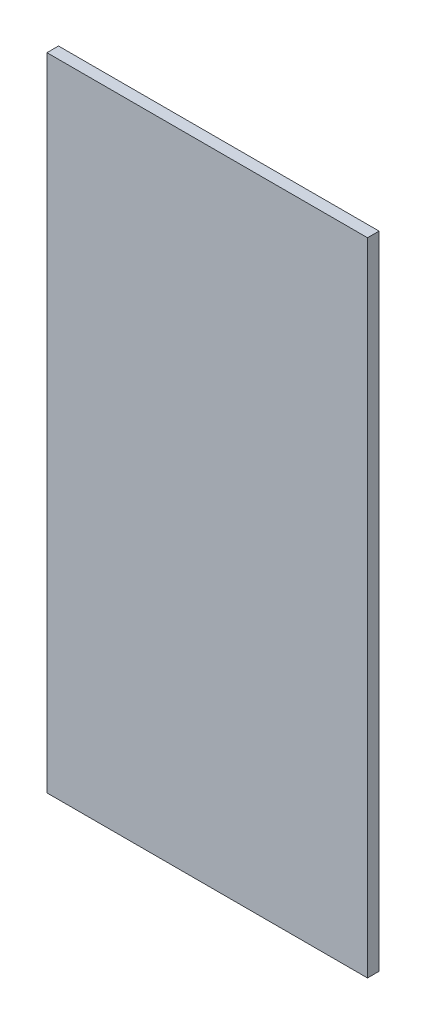
ISO-10303-21;
HEADER;
FILE_DESCRIPTION(('STEP AP214'),'2;1');
FILE_NAME('part.step','',(''),(''),'','','');
FILE_SCHEMA(('AUTOMOTIVE_DESIGN { 1 0 10303 214 1 1 1 1 }'));
ENDSEC;
DATA;
#1=APPLICATION_CONTEXT('core data for automotive mechanical design processes');
#2=APPLICATION_PROTOCOL_DEFINITION('international standard','automotive_design',2000,#1);
#3=PRODUCT_CONTEXT('',#1,'mechanical');
#4=PRODUCT('Part','Part','',(#3));
#5=PRODUCT_RELATED_PRODUCT_CATEGORY('part','',(#4));
#6=PRODUCT_DEFINITION_FORMATION('','',#4);
#7=PRODUCT_DEFINITION_CONTEXT('part definition',#1,'design');
#8=PRODUCT_DEFINITION('design','',#6,#7);
#9=PRODUCT_DEFINITION_SHAPE('','',#8);
#10=(LENGTH_UNIT() NAMED_UNIT(*) SI_UNIT(.MILLI.,.METRE.));
#11=(NAMED_UNIT(*) PLANE_ANGLE_UNIT() SI_UNIT($,.RADIAN.));
#12=(NAMED_UNIT(*) SI_UNIT($,.STERADIAN.) SOLID_ANGLE_UNIT());
#13=UNCERTAINTY_MEASURE_WITH_UNIT(LENGTH_MEASURE(1.E-05),#10,'distance_accuracy_value','');
#14=(GEOMETRIC_REPRESENTATION_CONTEXT(3) GLOBAL_UNCERTAINTY_ASSIGNED_CONTEXT((#13)) GLOBAL_UNIT_ASSIGNED_CONTEXT((#10,
#11,#12)) REPRESENTATION_CONTEXT('',''));
#15=CARTESIAN_POINT('',(0.,0.,0.));
#16=DIRECTION('',(0.,0.,1.));
#17=DIRECTION('',(1.,0.,0.));
#18=AXIS2_PLACEMENT_3D('',#15,#16,#17);
#19=CARTESIAN_POINT('',(-0.375,-0.5,-0.018));
#20=DIRECTION('',(0.,1.,0.));
#21=DIRECTION('',(0.,0.,1.));
#22=AXIS2_PLACEMENT_3D('',#19,#20,#21);
#23=PLANE('',#22);
#24=CARTESIAN_POINT('',(-0.375,-0.5,-0.018));
#25=CARTESIAN_POINT('',(-0.875,-0.5,-0.018));
#26=B_SPLINE_CURVE_WITH_KNOTS('',1,(#24,#25),.UNSPECIFIED.,.F.,.F.,(2,2),(-3.,-2.5),.UNSPECIFIED.);
#27=CARTESIAN_POINT('',(-0.375,-0.5,-0.018));
#28=VERTEX_POINT('',#27);
#29=CARTESIAN_POINT('',(-0.875,-0.5,-0.018));
#30=VERTEX_POINT('',#29);
#31=EDGE_CURVE('E11',#28,#30,#26,.T.);
#32=ORIENTED_EDGE('',*,*,#31,.T.);
#33=CARTESIAN_POINT('',(-0.875,-0.5,-0.018));
#34=CARTESIAN_POINT('',(-0.875,-0.5,0.));
#35=B_SPLINE_CURVE_WITH_KNOTS('',1,(#33,#34),.UNSPECIFIED.,.F.,.F.,(2,2),(0.,0.018),.UNSPECIFIED.);
#36=CARTESIAN_POINT('',(-0.875,-0.5,0.));
#37=VERTEX_POINT('',#36);
#38=EDGE_CURVE('E26',#30,#37,#35,.T.);
#39=ORIENTED_EDGE('',*,*,#38,.T.);
#40=CARTESIAN_POINT('',(-0.375,-0.5,0.));
#41=CARTESIAN_POINT('',(-0.875,-0.5,0.));
#42=B_SPLINE_CURVE_WITH_KNOTS('',1,(#40,#41),.UNSPECIFIED.,.F.,.F.,(2,2),(-3.,-2.5),.UNSPECIFIED.);
#43=CARTESIAN_POINT('',(-0.375,-0.5,0.));
#44=VERTEX_POINT('',#43);
#45=EDGE_CURVE('E132',#44,#37,#42,.T.);
#46=ORIENTED_EDGE('',*,*,#45,.F.);
#47=CARTESIAN_POINT('',(-0.375,-0.5,-0.018));
#48=CARTESIAN_POINT('',(-0.375,-0.5,0.));
#49=B_SPLINE_CURVE_WITH_KNOTS('',1,(#47,#48),.UNSPECIFIED.,.F.,.F.,(2,2),(0.,0.018),.UNSPECIFIED.);
#50=EDGE_CURVE('E79',#28,#44,#49,.T.);
#51=ORIENTED_EDGE('',*,*,#50,.F.);
#52=EDGE_LOOP('',(#32,#39,#46,#51));
#53=FACE_BOUND('',#52,.T.);
#54=ADVANCED_FACE('F17',(#53),#23,.T.);
#55=CARTESIAN_POINT('',(-0.875,-0.5,-0.018));
#56=DIRECTION('',(-1.,0.,0.));
#57=DIRECTION('',(0.,0.,-1.));
#58=AXIS2_PLACEMENT_3D('',#55,#56,#57);
#59=PLANE('',#58);
#60=CARTESIAN_POINT('',(-0.875,-0.5,-0.018));
#61=CARTESIAN_POINT('',(-0.875,-1.5,-0.018));
#62=B_SPLINE_CURVE_WITH_KNOTS('',1,(#60,#61),.UNSPECIFIED.,.F.,.F.,(2,2),(-2.5,-1.5),.UNSPECIFIED.);
#63=CARTESIAN_POINT('',(-0.875,-1.5,-0.018));
#64=VERTEX_POINT('',#63);
#65=EDGE_CURVE('E119',#30,#64,#62,.T.);
#66=ORIENTED_EDGE('',*,*,#65,.T.);
#67=CARTESIAN_POINT('',(-0.875,-1.5,-0.018));
#68=CARTESIAN_POINT('',(-0.875,-1.5,0.));
#69=B_SPLINE_CURVE_WITH_KNOTS('',1,(#67,#68),.UNSPECIFIED.,.F.,.F.,(2,2),(0.,0.018),.UNSPECIFIED.);
#70=CARTESIAN_POINT('',(-0.875,-1.5,0.));
#71=VERTEX_POINT('',#70);
#72=EDGE_CURVE('E112',#64,#71,#69,.T.);
#73=ORIENTED_EDGE('',*,*,#72,.T.);
#74=CARTESIAN_POINT('',(-0.875,-0.5,0.));
#75=CARTESIAN_POINT('',(-0.875,-1.5,0.));
#76=B_SPLINE_CURVE_WITH_KNOTS('',1,(#74,#75),.UNSPECIFIED.,.F.,.F.,(2,2),(-2.5,-1.5),.UNSPECIFIED.);
#77=EDGE_CURVE('E74',#37,#71,#76,.T.);
#78=ORIENTED_EDGE('',*,*,#77,.F.);
#79=ORIENTED_EDGE('',*,*,#38,.F.);
#80=EDGE_LOOP('',(#66,#73,#78,#79));
#81=FACE_BOUND('',#80,.T.);
#82=ADVANCED_FACE('F147',(#81),#59,.T.);
#83=CARTESIAN_POINT('',(-0.875,-1.5,-0.018));
#84=DIRECTION('',(0.,-1.,0.));
#85=DIRECTION('',(0.,0.,-1.));
#86=AXIS2_PLACEMENT_3D('',#83,#84,#85);
#87=PLANE('',#86);
#88=CARTESIAN_POINT('',(-0.875,-1.5,-0.018));
#89=CARTESIAN_POINT('',(-0.375,-1.5,-0.018));
#90=B_SPLINE_CURVE_WITH_KNOTS('',1,(#88,#89),.UNSPECIFIED.,.F.,.F.,(2,2),(-1.5,-1.),.UNSPECIFIED.);
#91=CARTESIAN_POINT('',(-0.375,-1.5,-0.018));
#92=VERTEX_POINT('',#91);
#93=EDGE_CURVE('E62',#64,#92,#90,.T.);
#94=ORIENTED_EDGE('',*,*,#93,.T.);
#95=CARTESIAN_POINT('',(-0.375,-1.5,-0.018));
#96=CARTESIAN_POINT('',(-0.375,-1.5,0.));
#97=B_SPLINE_CURVE_WITH_KNOTS('',1,(#95,#96),.UNSPECIFIED.,.F.,.F.,(2,2),(0.,0.018),.UNSPECIFIED.);
#98=CARTESIAN_POINT('',(-0.375,-1.5,0.));
#99=VERTEX_POINT('',#98);
#100=EDGE_CURVE('E56',#92,#99,#97,.T.);
#101=ORIENTED_EDGE('',*,*,#100,.T.);
#102=CARTESIAN_POINT('',(-0.875,-1.5,0.));
#103=CARTESIAN_POINT('',(-0.375,-1.5,0.));
#104=B_SPLINE_CURVE_WITH_KNOTS('',1,(#102,#103),.UNSPECIFIED.,.F.,.F.,(2,2),(-1.5,-1.),.UNSPECIFIED.);
#105=EDGE_CURVE('E60',#71,#99,#104,.T.);
#106=ORIENTED_EDGE('',*,*,#105,.F.);
#107=ORIENTED_EDGE('',*,*,#72,.F.);
#108=EDGE_LOOP('',(#94,#101,#106,#107));
#109=FACE_BOUND('',#108,.T.);
#110=ADVANCED_FACE('F58',(#109),#87,.T.);
#111=CARTESIAN_POINT('',(-0.375,-1.5,-0.018));
#112=DIRECTION('',(1.,0.,0.));
#113=DIRECTION('',(0.,0.,1.));
#114=AXIS2_PLACEMENT_3D('',#111,#112,#113);
#115=PLANE('',#114);
#116=CARTESIAN_POINT('',(-0.375,-1.5,-0.018));
#117=CARTESIAN_POINT('',(-0.375,-0.5,-0.018));
#118=B_SPLINE_CURVE_WITH_KNOTS('',1,(#116,#117),.UNSPECIFIED.,.F.,.F.,(2,2),(-1.,0.),.UNSPECIFIED.);
#119=EDGE_CURVE('E75',#92,#28,#118,.T.);
#120=ORIENTED_EDGE('',*,*,#119,.T.);
#121=ORIENTED_EDGE('',*,*,#50,.T.);
#122=CARTESIAN_POINT('',(-0.375,-1.5,0.));
#123=CARTESIAN_POINT('',(-0.375,-0.5,0.));
#124=B_SPLINE_CURVE_WITH_KNOTS('',1,(#122,#123),.UNSPECIFIED.,.F.,.F.,(2,2),(-1.,0.),.UNSPECIFIED.);
#125=EDGE_CURVE('E72',#99,#44,#124,.T.);
#126=ORIENTED_EDGE('',*,*,#125,.F.);
#127=ORIENTED_EDGE('',*,*,#100,.F.);
#128=EDGE_LOOP('',(#120,#121,#126,#127));
#129=FACE_BOUND('',#128,.T.);
#130=ADVANCED_FACE('F78',(#129),#115,.T.);
#131=CARTESIAN_POINT('',(-0.375,-0.5,-0.018));
#132=DIRECTION('',(0.,0.,-1.));
#133=DIRECTION('',(-1.,0.,0.));
#134=AXIS2_PLACEMENT_3D('',#131,#132,#133);
#135=PLANE('',#134);
#136=ORIENTED_EDGE('',*,*,#119,.F.);
#137=ORIENTED_EDGE('',*,*,#93,.F.);
#138=ORIENTED_EDGE('',*,*,#65,.F.);
#139=ORIENTED_EDGE('',*,*,#31,.F.);
#140=EDGE_LOOP('',(#136,#137,#138,#139));
#141=FACE_BOUND('',#140,.T.);
#142=ADVANCED_FACE('F148',(#141),#135,.T.);
#143=CARTESIAN_POINT('',(-0.375,-0.5,0.));
#144=DIRECTION('',(0.,0.,1.));
#145=DIRECTION('',(1.,0.,0.));
#146=AXIS2_PLACEMENT_3D('',#143,#144,#145);
#147=PLANE('',#146);
#148=ORIENTED_EDGE('',*,*,#45,.T.);
#149=ORIENTED_EDGE('',*,*,#77,.T.);
#150=ORIENTED_EDGE('',*,*,#105,.T.);
#151=ORIENTED_EDGE('',*,*,#125,.T.);
#152=EDGE_LOOP('',(#148,#149,#150,#151));
#153=FACE_BOUND('',#152,.T.);
#154=ADVANCED_FACE('F71',(#153),#147,.T.);
#155=CLOSED_SHELL('',(#54,#82,#110,#130,#142,#154));
#156=MANIFOLD_SOLID_BREP('B1',#155);
#157=ADVANCED_BREP_SHAPE_REPRESENTATION('',(#18,#156),#14);
#158=SHAPE_DEFINITION_REPRESENTATION(#9,#157);
ENDSEC;
END-ISO-10303-21;
